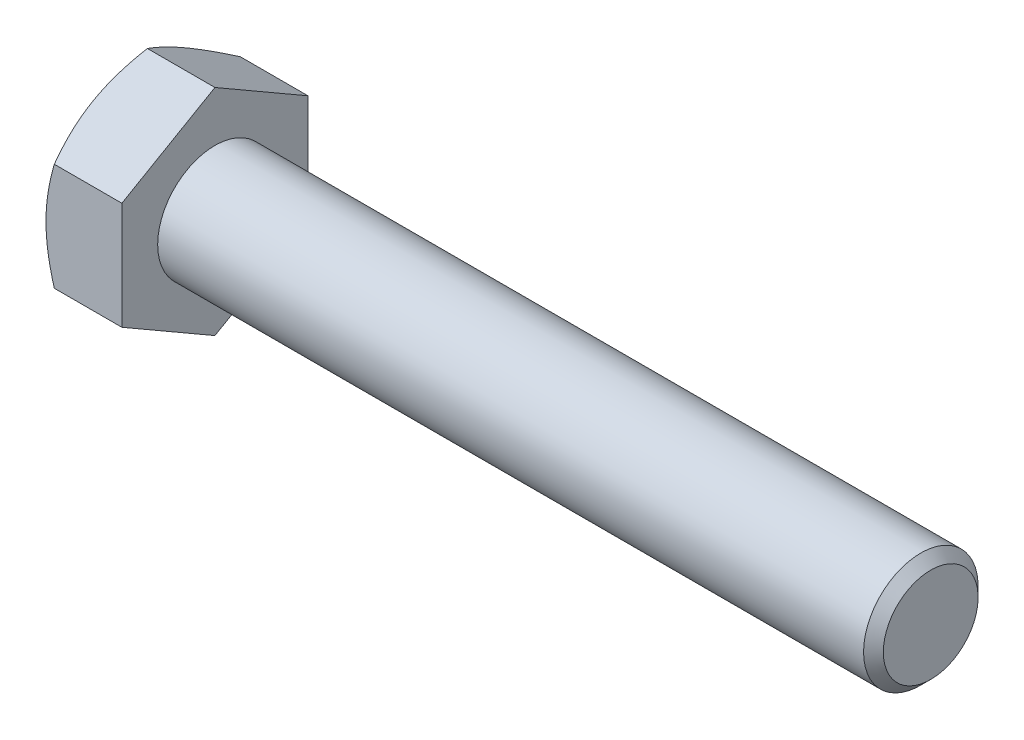
ISO-10303-21;
HEADER;
FILE_DESCRIPTION(('STEP AP214'),'2;1');
FILE_NAME('part.step','',(''),(''),'','','');
FILE_SCHEMA(('AUTOMOTIVE_DESIGN { 1 0 10303 214 1 1 1 1 }'));
ENDSEC;
DATA;
#1=APPLICATION_CONTEXT('core data for automotive mechanical design processes');
#2=APPLICATION_PROTOCOL_DEFINITION('international standard','automotive_design',2000,#1);
#3=PRODUCT_CONTEXT('',#1,'mechanical');
#4=PRODUCT('Part','Part','',(#3));
#5=PRODUCT_RELATED_PRODUCT_CATEGORY('part','',(#4));
#6=PRODUCT_DEFINITION_FORMATION('','',#4);
#7=PRODUCT_DEFINITION_CONTEXT('part definition',#1,'design');
#8=PRODUCT_DEFINITION('design','',#6,#7);
#9=PRODUCT_DEFINITION_SHAPE('','',#8);
#10=(LENGTH_UNIT() NAMED_UNIT(*) SI_UNIT(.MILLI.,.METRE.));
#11=(NAMED_UNIT(*) PLANE_ANGLE_UNIT() SI_UNIT($,.RADIAN.));
#12=(NAMED_UNIT(*) SI_UNIT($,.STERADIAN.) SOLID_ANGLE_UNIT());
#13=UNCERTAINTY_MEASURE_WITH_UNIT(LENGTH_MEASURE(1.E-05),#10,'distance_accuracy_value','');
#14=(GEOMETRIC_REPRESENTATION_CONTEXT(3) GLOBAL_UNCERTAINTY_ASSIGNED_CONTEXT((#13)) GLOBAL_UNIT_ASSIGNED_CONTEXT((#10,
#11,#12)) REPRESENTATION_CONTEXT('',''));
#15=CARTESIAN_POINT('',(0.,0.,0.));
#16=DIRECTION('',(0.,0.,1.));
#17=DIRECTION('',(1.,0.,0.));
#18=AXIS2_PLACEMENT_3D('',#15,#16,#17);
#19=CARTESIAN_POINT('',(0.,7.50555349946514,0.));
#20=DIRECTION('',(1.,0.,0.));
#21=DIRECTION('',(0.,0.,-1.));
#22=AXIS2_PLACEMENT_3D('',#19,#20,#21);
#23=PLANE('',#22);
#24=CARTESIAN_POINT('',(0.,0.,0.));
#25=DIRECTION('',(1.,0.,0.));
#26=DIRECTION('',(0.,0.,-1.));
#27=AXIS2_PLACEMENT_3D('',#24,#25,#26);
#28=CIRCLE('',#27,6.49999999995998);
#29=CARTESIAN_POINT('',(1.15555477460892E-11,-5.62916512458153,-3.24999999999));
#30=VERTEX_POINT('',#29);
#31=CARTESIAN_POINT('',(1.1552457738841E-11,0.,-6.49999999997999));
#32=VERTEX_POINT('',#31);
#33=EDGE_CURVE('E376',#30,#32,#28,.T.);
#34=ORIENTED_EDGE('',*,*,#33,.F.);
#35=CARTESIAN_POINT('',(0.,0.,0.));
#36=DIRECTION('',(1.,0.,0.));
#37=DIRECTION('',(0.,0.,-1.));
#38=AXIS2_PLACEMENT_3D('',#35,#36,#37);
#39=CIRCLE('',#38,6.49999999995998);
#40=CARTESIAN_POINT('',(1.15550411053332E-11,-5.62916512458152,3.24999999999001));
#41=VERTEX_POINT('',#40);
#42=EDGE_CURVE('E374',#41,#30,#39,.T.);
#43=ORIENTED_EDGE('',*,*,#42,.F.);
#44=CARTESIAN_POINT('',(0.,0.,0.));
#45=DIRECTION('',(1.,0.,0.));
#46=DIRECTION('',(0.,0.,-1.));
#47=AXIS2_PLACEMENT_3D('',#44,#45,#46);
#48=CIRCLE('',#47,6.49999999995998);
#49=CARTESIAN_POINT('',(1.15521679258111E-11,0.,6.49999999997999));
#50=VERTEX_POINT('',#49);
#51=EDGE_CURVE('E89',#50,#41,#48,.T.);
#52=ORIENTED_EDGE('',*,*,#51,.F.);
#53=CARTESIAN_POINT('',(0.,0.,0.));
#54=DIRECTION('',(1.,0.,0.));
#55=DIRECTION('',(0.,0.,-1.));
#56=AXIS2_PLACEMENT_3D('',#53,#54,#55);
#57=CIRCLE('',#56,6.49999999995998);
#58=CARTESIAN_POINT('',(1.15524765323843E-11,5.62916512458152,3.24999999999));
#59=VERTEX_POINT('',#58);
#60=EDGE_CURVE('E87',#59,#50,#57,.T.);
#61=ORIENTED_EDGE('',*,*,#60,.F.);
#62=CARTESIAN_POINT('',(0.,0.,0.));
#63=DIRECTION('',(1.,0.,0.));
#64=DIRECTION('',(0.,0.,-1.));
#65=AXIS2_PLACEMENT_3D('',#62,#63,#64);
#66=CIRCLE('',#65,6.49999999995998);
#67=CARTESIAN_POINT('',(1.15520344122427E-11,5.62916512458152,-3.24999999999));
#68=VERTEX_POINT('',#67);
#69=EDGE_CURVE('E19',#68,#59,#66,.T.);
#70=ORIENTED_EDGE('',*,*,#69,.F.);
#71=CARTESIAN_POINT('',(0.,0.,0.));
#72=DIRECTION('',(1.,0.,0.));
#73=DIRECTION('',(0.,0.,-1.));
#74=AXIS2_PLACEMENT_3D('',#71,#72,#73);
#75=CIRCLE('',#74,6.49999999995998);
#76=EDGE_CURVE('E290',#32,#68,#75,.T.);
#77=ORIENTED_EDGE('',*,*,#76,.F.);
#78=EDGE_LOOP('',(#34,#43,#52,#61,#70,#77));
#79=FACE_BOUND('',#78,.T.);
#80=ADVANCED_FACE('F16',(#79),#23,.F.);
#81=CARTESIAN_POINT('',(0.584039923126056,0.,0.));
#82=DIRECTION('',(1.,0.,0.));
#83=DIRECTION('',(0.,0.,-1.));
#84=AXIS2_PLACEMENT_3D('',#81,#82,#83);
#85=CONICAL_SURFACE('',#84,7.51158682049891,1.047197551212);
#86=CARTESIAN_POINT('',(0.580556583603038,7.50555349946481,-5.68456481556597E-13));
#87=CARTESIAN_POINT('',(0.492351589092373,7.35281628523265,-0.26454861525721));
#88=CARTESIAN_POINT('',(0.411540414604503,7.19885589650209,-0.531215830891591));
#89=CARTESIAN_POINT('',(0.269031363386546,6.88957797343578,-1.06690090730181));
#90=CARTESIAN_POINT('',(0.207238975555895,6.73427122699289,-1.33590008289911));
#91=CARTESIAN_POINT('',(0.131368414291871,6.49984538856281,-1.74193754566694));
#92=CARTESIAN_POINT('',(0.108872020464256,6.42140731241997,-1.8777962787943));
#93=CARTESIAN_POINT('',(0.0699302938009757,6.264155645091,-2.15016415618299));
#94=CARTESIAN_POINT('',(0.0534848017009781,6.18534206384378,-2.28667328322963));
#95=CARTESIAN_POINT('',(0.0269338255085263,6.02704786462284,-2.56084687882373));
#96=CARTESIAN_POINT('',(0.0168605830574699,5.94756588426557,-2.69851370708872));
#97=CARTESIAN_POINT('',(0.00337972763244669,5.78844560823805,-2.97411810968276));
#98=CARTESIAN_POINT('',(-2.65652346789022E-05,5.70880728473494,-3.11205573221976));
#99=CARTESIAN_POINT('',(2.31040688244853E-11,5.62916512459895,-3.24999999999983));
#100=B_SPLINE_CURVE_WITH_KNOTS('',3,(#86,#87,#88,#89,#90,#91,#92,#93,#94,#95,#96,#97,#98,#99),
.UNSPECIFIED.,.F.,.F.,(4,2,2,2,2,2,4),(0.,0.954247655906537,1.9036737621373,2.37900973801286,
2.85433320178906,3.332042816259,3.80984701130876),.UNSPECIFIED.);
#101=CARTESIAN_POINT('',(0.580556583603038,7.50555349946481,0.));
#102=VERTEX_POINT('',#101);
#103=EDGE_CURVE('E100',#102,#68,#100,.T.);
#104=ORIENTED_EDGE('',*,*,#103,.T.);
#105=ORIENTED_EDGE('',*,*,#69,.T.);
#106=CARTESIAN_POINT('',(2.38262969880455E-11,5.62916512459777,3.24999999999938));
#107=CARTESIAN_POINT('',(-2.65652344219582E-05,5.70880728473446,3.11205573221969));
#108=CARTESIAN_POINT('',(0.00337972763251203,5.78844560823787,2.97411810968284));
#109=CARTESIAN_POINT('',(0.016860583057394,5.94756588426561,2.69851370708889));
#110=CARTESIAN_POINT('',(0.0269338255085004,6.02704786462282,2.56084687882384));
#111=CARTESIAN_POINT('',(0.0534848017009882,6.18534206384371,2.28667328322969));
#112=CARTESIAN_POINT('',(0.0699302938009718,6.26415564509096,2.15016415618305));
#113=CARTESIAN_POINT('',(0.108872020464242,6.42140731241995,1.87779627879436));
#114=CARTESIAN_POINT('',(0.131368414291862,6.49984538856279,1.74193754566698));
#115=CARTESIAN_POINT('',(0.207238975555892,6.73427122699287,1.33590008289914));
#116=CARTESIAN_POINT('',(0.269031363386541,6.88957797343576,1.06690090730184));
#117=CARTESIAN_POINT('',(0.411540414604495,7.19885589650208,0.531215830891611));
#118=CARTESIAN_POINT('',(0.492351589092366,7.35281628523265,0.264548615257222));
#119=CARTESIAN_POINT('',(0.580556583603039,7.50555349946481,5.67774003086218E-13));
#120=B_SPLINE_CURVE_WITH_KNOTS('',3,(#106,#107,#108,#109,#110,#111,#112,#113,#114,#115,#116,
#117,#118,#119),.UNSPECIFIED.,.F.,.F.,(4,2,2,2,2,2,4),(0.,0.477804195049821,0.955513809519796,
1.43083727329602,1.90617324917161,2.85559935540238,3.80984701130895),.UNSPECIFIED.);
#121=EDGE_CURVE('E98',#59,#102,#120,.T.);
#122=ORIENTED_EDGE('',*,*,#121,.T.);
#123=EDGE_LOOP('',(#104,#105,#122));
#124=FACE_BOUND('',#123,.T.);
#125=ADVANCED_FACE('F96',(#124),#85,.T.);
#126=CARTESIAN_POINT('',(0.584039923126056,0.,0.));
#127=DIRECTION('',(1.,0.,0.));
#128=DIRECTION('',(0.,0.,-1.));
#129=AXIS2_PLACEMENT_3D('',#126,#127,#128);
#130=CONICAL_SURFACE('',#129,7.51158682049891,1.047197551212);
#131=CARTESIAN_POINT('',(0.580556583603035,3.75277674973289,6.49999999999943));
#132=CARTESIAN_POINT('',(0.49235158909237,3.90551396396506,6.23545138474279));
#133=CARTESIAN_POINT('',(0.411540414604501,4.05947435269561,5.96878416910841));
#134=CARTESIAN_POINT('',(0.269031363386546,4.36875227576192,5.4330990926982));
#135=CARTESIAN_POINT('',(0.207238975555895,4.5240590222048,5.1640999171009));
#136=CARTESIAN_POINT('',(0.131368414291871,4.75848486063488,4.75806245433307));
#137=CARTESIAN_POINT('',(0.108872020464256,4.83692293677773,4.62220372120571));
#138=CARTESIAN_POINT('',(0.0699302938009757,4.99417460410669,4.34983584381702));
#139=CARTESIAN_POINT('',(0.0534848017009788,5.07298818535391,4.21332671677038));
#140=CARTESIAN_POINT('',(0.0269338255085272,5.23128238457485,3.93915312117628));
#141=CARTESIAN_POINT('',(0.0168605830574704,5.31076436493213,3.80148629291129));
#142=CARTESIAN_POINT('',(0.00337972763244649,5.46988464095964,3.52588189031725));
#143=CARTESIAN_POINT('',(-2.6565234679261E-05,5.54952296446275,3.38794426778026));
#144=CARTESIAN_POINT('',(2.31044109636824E-11,5.62916512459874,3.25000000000019));
#145=B_SPLINE_CURVE_WITH_KNOTS('',3,(#131,#132,#133,#134,#135,#136,#137,#138,#139,#140,#141,
#142,#143,#144),.UNSPECIFIED.,.F.,.F.,(4,2,2,2,2,2,4),(0.,0.954247655906532,1.90367376213729,
2.37900973801285,2.85433320178905,3.33204281625899,3.80984701130875),.UNSPECIFIED.);
#146=CARTESIAN_POINT('',(0.580556583603035,3.7527767497324,6.49999999999972));
#147=VERTEX_POINT('',#146);
#148=EDGE_CURVE('E104',#147,#59,#145,.T.);
#149=ORIENTED_EDGE('',*,*,#148,.T.);
#150=ORIENTED_EDGE('',*,*,#60,.T.);
#151=CARTESIAN_POINT('',(2.38266512998069E-11,0.,6.49999999999875));
#152=CARTESIAN_POINT('',(-2.65652344227332E-05,0.159284320272008,6.49999999999955));
#153=CARTESIAN_POINT('',(0.0033797276325113,0.31856096727825,6.49999999999988));
#154=CARTESIAN_POINT('',(0.0168605830573939,0.636801519333313,6.50000000000012));
#155=CARTESIAN_POINT('',(0.0269338255085009,0.795765480047878,6.50000000000003));
#156=CARTESIAN_POINT('',(0.0534848017009887,1.11235387848978,6.49999999999997));
#157=CARTESIAN_POINT('',(0.0699302938009717,1.26998104098423,6.49999999999999));
#158=CARTESIAN_POINT('',(0.108872020464242,1.58448437564217,6.50000000000001));
#159=CARTESIAN_POINT('',(0.131368414291861,1.74136052792787,6.5));
#160=CARTESIAN_POINT('',(0.207238975555891,2.21021220478804,6.49999999999999));
#161=CARTESIAN_POINT('',(0.26903136338654,2.52082569767382,6.5));
#162=CARTESIAN_POINT('',(0.411540414604493,3.13938154380644,6.5));
#163=CARTESIAN_POINT('',(0.492351589092363,3.44730232126757,6.50000000000001));
#164=CARTESIAN_POINT('',(0.580556583603035,3.75277674973191,6.5));
#165=B_SPLINE_CURVE_WITH_KNOTS('',3,(#151,#152,#153,#154,#155,#156,#157,#158,#159,#160,#161,
#162,#163,#164),.UNSPECIFIED.,.F.,.F.,(4,2,2,2,2,2,4),(0.,0.477804195049819,0.955513809519793,
1.43083727329602,1.90617324917161,2.85559935540237,3.80984701130894),.UNSPECIFIED.);
#166=EDGE_CURVE('E107',#50,#147,#165,.T.);
#167=ORIENTED_EDGE('',*,*,#166,.T.);
#168=EDGE_LOOP('',(#149,#150,#167));
#169=FACE_BOUND('',#168,.T.);
#170=ADVANCED_FACE('F105',(#169),#130,.T.);
#171=CARTESIAN_POINT('',(0.584039923126056,0.,0.));
#172=DIRECTION('',(1.,0.,0.));
#173=DIRECTION('',(0.,0.,-1.));
#174=AXIS2_PLACEMENT_3D('',#171,#172,#173);
#175=CONICAL_SURFACE('',#174,7.51158682049891,1.047197551212);
#176=ORIENTED_EDGE('',*,*,#51,.T.);
#177=CARTESIAN_POINT('',(2.38331262092634E-11,-5.62916512459777,3.24999999999939));
#178=CARTESIAN_POINT('',(-2.65652344164461E-05,-5.54952296446246,3.38794426777988));
#179=CARTESIAN_POINT('',(0.0033797276325173,-5.46988464095963,3.52588189031706));
#180=CARTESIAN_POINT('',(0.0168605830573994,-5.3107643649323,3.80148629291125));
#181=CARTESIAN_POINT('',(0.0269338255085061,-5.23128238457494,3.93915312117621));
#182=CARTESIAN_POINT('',(0.0534848017009937,-5.07298818535394,4.21332671677029));
#183=CARTESIAN_POINT('',(0.0699302938009766,-4.99417460410673,4.34983584381695));
#184=CARTESIAN_POINT('',(0.108872020464246,-4.83692293677778,4.62220372120566));
#185=CARTESIAN_POINT('',(0.131368414291866,-4.75848486063492,4.75806245433303));
#186=CARTESIAN_POINT('',(0.207238975555896,-4.52405902220483,5.16409991710086));
#187=CARTESIAN_POINT('',(0.269031363386544,-4.36875227576194,5.43309909269816));
#188=CARTESIAN_POINT('',(0.411540414604496,-4.05947435269564,5.96878416910839));
#189=CARTESIAN_POINT('',(0.492351589092366,-3.90551396396508,6.23545138474278));
#190=CARTESIAN_POINT('',(0.580556583603037,-3.7527767497329,6.49999999999943));
#191=B_SPLINE_CURVE_WITH_KNOTS('',3,(#177,#178,#179,#180,#181,#182,#183,#184,#185,#186,#187,
#188,#189,#190),.UNSPECIFIED.,.F.,.F.,(4,2,2,2,2,2,4),(0.,0.477804195049818,0.955513809519791,
1.43083727329601,1.9061732491716,2.85559935540236,3.80984701130893),.UNSPECIFIED.);
#192=CARTESIAN_POINT('',(0.580556583603037,-3.75277674973241,6.49999999999971));
#193=VERTEX_POINT('',#192);
#194=EDGE_CURVE('E189',#41,#193,#191,.T.);
#195=ORIENTED_EDGE('',*,*,#194,.T.);
#196=CARTESIAN_POINT('',(0.580556583603038,-3.75277674973192,6.5));
#197=CARTESIAN_POINT('',(0.492351589092373,-3.44730232126759,6.5));
#198=CARTESIAN_POINT('',(0.411540414604503,-3.13938154380647,6.5));
#199=CARTESIAN_POINT('',(0.269031363386547,-2.52082569767387,6.5));
#200=CARTESIAN_POINT('',(0.207238975555896,-2.21021220478809,6.5));
#201=CARTESIAN_POINT('',(0.131368414291872,-1.74136052792793,6.5));
#202=CARTESIAN_POINT('',(0.108872020464256,-1.58448437564224,6.5));
#203=CARTESIAN_POINT('',(0.069930293800976,-1.26998104098431,6.5));
#204=CARTESIAN_POINT('',(0.0534848017009787,-1.11235387848987,6.5));
#205=CARTESIAN_POINT('',(0.026933825508527,-0.795765480047989,6.5));
#206=CARTESIAN_POINT('',(0.0168605830574705,-0.636801519333436,6.5));
#207=CARTESIAN_POINT('',(0.00337972763244701,-0.318560967278408,6.5));
#208=CARTESIAN_POINT('',(-2.65652346786707E-05,-0.159284320272188,6.5));
#209=CARTESIAN_POINT('',(2.31044610445054E-11,-2.08059797367535E-13,6.5));
#210=B_SPLINE_CURVE_WITH_KNOTS('',3,(#196,#197,#198,#199,#200,#201,#202,#203,#204,#205,#206,
#207,#208,#209),.UNSPECIFIED.,.F.,.F.,(4,2,2,2,2,2,4),(0.,0.954247655906535,1.9036737621373,
2.37900973801286,2.85433320178906,3.33204281625899,3.80984701130876),.UNSPECIFIED.);
#211=EDGE_CURVE('E161',#193,#50,#210,.T.);
#212=ORIENTED_EDGE('',*,*,#211,.T.);
#213=EDGE_LOOP('',(#176,#195,#212));
#214=FACE_BOUND('',#213,.T.);
#215=ADVANCED_FACE('F150',(#214),#175,.T.);
#216=CARTESIAN_POINT('',(0.584039923126056,0.,0.));
#217=DIRECTION('',(1.,0.,0.));
#218=DIRECTION('',(0.,0.,-1.));
#219=AXIS2_PLACEMENT_3D('',#216,#217,#218);
#220=CONICAL_SURFACE('',#219,7.51158682049891,1.047197551212);
#221=ORIENTED_EDGE('',*,*,#42,.T.);
#222=CARTESIAN_POINT('',(2.38342887376555E-11,-5.62916512459777,-3.24999999999938));
#223=CARTESIAN_POINT('',(-2.65652344147577E-05,-5.70880728473447,-3.11205573221969));
#224=CARTESIAN_POINT('',(0.00337972763251886,-5.78844560823788,-2.97411810968284));
#225=CARTESIAN_POINT('',(0.0168605830574005,-5.94756588426562,-2.69851370708889));
#226=CARTESIAN_POINT('',(0.0269338255085069,-6.02704786462283,-2.56084687882384));
#227=CARTESIAN_POINT('',(0.0534848017009949,-6.18534206384372,-2.2866732832297));
#228=CARTESIAN_POINT('',(0.0699302938009785,-6.26415564509097,-2.15016415618305));
#229=CARTESIAN_POINT('',(0.108872020464249,-6.42140731241996,-1.87779627879436));
#230=CARTESIAN_POINT('',(0.131368414291869,-6.4998453885628,-1.74193754566699));
#231=CARTESIAN_POINT('',(0.207238975555899,-6.73427122699288,-1.33590008289914));
#232=CARTESIAN_POINT('',(0.269031363386548,-6.88957797343577,-1.06690090730184));
#233=CARTESIAN_POINT('',(0.411540414604502,-7.19885589650209,-0.531215830891612));
#234=CARTESIAN_POINT('',(0.492351589092373,-7.35281628523266,-0.264548615257222));
#235=CARTESIAN_POINT('',(0.580556583603045,-7.50555349946482,-5.67704371195565E-13));
#236=B_SPLINE_CURVE_WITH_KNOTS('',3,(#222,#223,#224,#225,#226,#227,#228,#229,#230,#231,#232,
#233,#234,#235),.UNSPECIFIED.,.F.,.F.,(4,2,2,2,2,2,4),(0.,0.47780419504982,0.955513809519797,
1.43083727329602,1.90617324917161,2.85559935540238,3.80984701130896),.UNSPECIFIED.);
#237=CARTESIAN_POINT('',(0.580556583603045,-7.50555349946482,0.));
#238=VERTEX_POINT('',#237);
#239=EDGE_CURVE('E342',#30,#238,#236,.T.);
#240=ORIENTED_EDGE('',*,*,#239,.T.);
#241=CARTESIAN_POINT('',(0.580556583603045,-7.50555349946482,5.69366376944182E-13));
#242=CARTESIAN_POINT('',(0.492351589092379,-7.35281628523266,0.264548615257211));
#243=CARTESIAN_POINT('',(0.411540414604509,-7.1988558965021,0.531215830891592));
#244=CARTESIAN_POINT('',(0.269031363386554,-6.8895779734358,1.06690090730181));
#245=CARTESIAN_POINT('',(0.207238975555903,-6.73427122699291,1.33590008289911));
#246=CARTESIAN_POINT('',(0.131368414291878,-6.49984538856283,1.74193754566694));
#247=CARTESIAN_POINT('',(0.108872020464262,-6.42140731241998,1.8777962787943));
#248=CARTESIAN_POINT('',(0.0699302938009814,-6.26415564509101,2.15016415618299));
#249=CARTESIAN_POINT('',(0.0534848017009844,-6.18534206384379,2.28667328322964));
#250=CARTESIAN_POINT('',(0.0269338255085328,-6.02704786462285,2.56084687882373));
#251=CARTESIAN_POINT('',(0.0168605830574762,-5.94756588426558,2.69851370708873));
#252=CARTESIAN_POINT('',(0.00337972763245243,-5.78844560823806,2.97411810968276));
#253=CARTESIAN_POINT('',(-2.65652346733646E-05,-5.70880728473495,3.11205573221976));
#254=CARTESIAN_POINT('',(2.31099570177832E-11,-5.62916512459896,3.24999999999983));
#255=B_SPLINE_CURVE_WITH_KNOTS('',3,(#241,#242,#243,#244,#245,#246,#247,#248,#249,#250,#251,
#252,#253,#254),.UNSPECIFIED.,.F.,.F.,(4,2,2,2,2,2,4),(0.,0.954247655906537,1.9036737621373,
2.37900973801286,2.85433320178906,3.332042816259,3.80984701130877),.UNSPECIFIED.);
#256=EDGE_CURVE('E183',#238,#41,#255,.T.);
#257=ORIENTED_EDGE('',*,*,#256,.T.);
#258=EDGE_LOOP('',(#221,#240,#257));
#259=FACE_BOUND('',#258,.T.);
#260=ADVANCED_FACE('F365',(#259),#220,.T.);
#261=CARTESIAN_POINT('',(0.584039923126056,0.,0.));
#262=DIRECTION('',(1.,0.,0.));
#263=DIRECTION('',(0.,0.,-1.));
#264=AXIS2_PLACEMENT_3D('',#261,#262,#263);
#265=CONICAL_SURFACE('',#264,7.51158682049891,1.047197551212);
#266=ORIENTED_EDGE('',*,*,#33,.T.);
#267=CARTESIAN_POINT('',(2.38274285891329E-11,0.,-6.49999999999875));
#268=CARTESIAN_POINT('',(-2.6565234421441E-05,-0.159284320272008,-6.49999999999955));
#269=CARTESIAN_POINT('',(0.00337972763251244,-0.318560967278251,-6.49999999999988));
#270=CARTESIAN_POINT('',(0.0168605830573945,-0.636801519333316,-6.50000000000012));
#271=CARTESIAN_POINT('',(0.0269338255085012,-0.795765480047881,-6.50000000000003));
#272=CARTESIAN_POINT('',(0.0534848017009894,-1.11235387848978,-6.49999999999997));
#273=CARTESIAN_POINT('',(0.069930293800973,-1.26998104098423,-6.49999999999999));
#274=CARTESIAN_POINT('',(0.108872020464243,-1.58448437564218,-6.50000000000001));
#275=CARTESIAN_POINT('',(0.131368414291863,-1.74136052792788,-6.50000000000001));
#276=CARTESIAN_POINT('',(0.207238975555893,-2.21021220478805,-6.5));
#277=CARTESIAN_POINT('',(0.269031363386542,-2.52082569767383,-6.5));
#278=CARTESIAN_POINT('',(0.411540414604496,-3.13938154380645,-6.50000000000001));
#279=CARTESIAN_POINT('',(0.492351589092367,-3.44730232126758,-6.50000000000001));
#280=CARTESIAN_POINT('',(0.580556583603039,-3.75277674973192,-6.5));
#281=B_SPLINE_CURVE_WITH_KNOTS('',3,(#267,#268,#269,#270,#271,#272,#273,#274,#275,#276,#277,
#278,#279,#280),.UNSPECIFIED.,.F.,.F.,(4,2,2,2,2,2,4),(0.,0.477804195049821,0.955513809519797,
1.43083727329602,1.90617324917161,2.85559935540238,3.80984701130895),.UNSPECIFIED.);
#282=CARTESIAN_POINT('',(0.580556583603039,-3.75277674973241,-6.49999999999972));
#283=VERTEX_POINT('',#282);
#284=EDGE_CURVE('E265',#32,#283,#281,.T.);
#285=ORIENTED_EDGE('',*,*,#284,.T.);
#286=CARTESIAN_POINT('',(0.580556583603039,-3.75277674973291,-6.49999999999943));
#287=CARTESIAN_POINT('',(0.492351589092374,-3.90551396396507,-6.23545138474279));
#288=CARTESIAN_POINT('',(0.411540414604505,-4.05947435269563,-5.96878416910841));
#289=CARTESIAN_POINT('',(0.269031363386551,-4.36875227576193,-5.4330990926982));
#290=CARTESIAN_POINT('',(0.2072389755559,-4.52405902220482,-5.1640999171009));
#291=CARTESIAN_POINT('',(0.131368414291877,-4.7584848606349,-4.75806245433307));
#292=CARTESIAN_POINT('',(0.108872020464262,-4.83692293677774,-4.62220372120571));
#293=CARTESIAN_POINT('',(0.0699302938009821,-4.9941746041067,-4.34983584381703));
#294=CARTESIAN_POINT('',(0.0534848017009851,-5.07298818535393,-4.21332671677038));
#295=CARTESIAN_POINT('',(0.0269338255085335,-5.23128238457487,-3.93915312117628));
#296=CARTESIAN_POINT('',(0.0168605830574768,-5.31076436493214,-3.80148629291129));
#297=CARTESIAN_POINT('',(0.00337972763245304,-5.46988464095966,-3.52588189031725));
#298=CARTESIAN_POINT('',(-2.65652346726809E-05,-5.54952296446277,-3.38794426778026));
#299=CARTESIAN_POINT('',(2.3110845106412E-11,-5.62916512459875,-3.25000000000019));
#300=B_SPLINE_CURVE_WITH_KNOTS('',3,(#286,#287,#288,#289,#290,#291,#292,#293,#294,#295,#296,
#297,#298,#299),.UNSPECIFIED.,.F.,.F.,(4,2,2,2,2,2,4),(0.,0.954247655906531,1.90367376213729,
2.37900973801285,2.85433320178905,3.33204281625898,3.80984701130874),.UNSPECIFIED.);
#301=EDGE_CURVE('E341',#283,#30,#300,.T.);
#302=ORIENTED_EDGE('',*,*,#301,.T.);
#303=EDGE_LOOP('',(#266,#285,#302));
#304=FACE_BOUND('',#303,.T.);
#305=ADVANCED_FACE('F280',(#304),#265,.T.);
#306=CARTESIAN_POINT('',(0.584039923126056,0.,0.));
#307=DIRECTION('',(1.,0.,0.));
#308=DIRECTION('',(0.,0.,-1.));
#309=AXIS2_PLACEMENT_3D('',#306,#307,#308);
#310=CONICAL_SURFACE('',#309,7.51158682049891,1.047197551212);
#311=CARTESIAN_POINT('',(0.580556583603034,3.7527767497319,-6.5));
#312=CARTESIAN_POINT('',(0.49235158909237,3.44730232126758,-6.5));
#313=CARTESIAN_POINT('',(0.4115404146045,3.13938154380646,-6.5));
#314=CARTESIAN_POINT('',(0.269031363386546,2.52082569767386,-6.5));
#315=CARTESIAN_POINT('',(0.207238975555895,2.21021220478808,-6.5));
#316=CARTESIAN_POINT('',(0.131368414291872,1.74136052792792,-6.5));
#317=CARTESIAN_POINT('',(0.108872020464256,1.58448437564224,-6.5));
#318=CARTESIAN_POINT('',(0.069930293800976,1.26998104098431,-6.5));
#319=CARTESIAN_POINT('',(0.0534848017009787,1.11235387848986,-6.5));
#320=CARTESIAN_POINT('',(0.0269338255085272,0.795765480047986,-6.5));
#321=CARTESIAN_POINT('',(0.016860583057471,0.636801519333434,-6.5));
#322=CARTESIAN_POINT('',(0.00337972763244778,0.318560967278407,-6.5));
#323=CARTESIAN_POINT('',(-2.65652346778902E-05,0.159284320272187,-6.5));
#324=CARTESIAN_POINT('',(2.3104915477682E-11,2.07807434490731E-13,-6.5));
#325=B_SPLINE_CURVE_WITH_KNOTS('',3,(#311,#312,#313,#314,#315,#316,#317,#318,#319,#320,#321,
#322,#323,#324),.UNSPECIFIED.,.F.,.F.,(4,2,2,2,2,2,4),(0.,0.954247655906532,1.90367376213729,
2.37900973801285,2.85433320178905,3.33204281625898,3.80984701130874),.UNSPECIFIED.);
#326=CARTESIAN_POINT('',(0.580556583603129,3.75277674973273,-6.49999999999972));
#327=VERTEX_POINT('',#326);
#328=EDGE_CURVE('E255',#327,#32,#325,.T.);
#329=ORIENTED_EDGE('',*,*,#328,.T.);
#330=ORIENTED_EDGE('',*,*,#76,.T.);
#331=CARTESIAN_POINT('',(2.38257762237078E-11,5.62916512459776,-3.24999999999938));
#332=CARTESIAN_POINT('',(-2.65652344229916E-05,5.54952296446245,-3.38794426777988));
#333=CARTESIAN_POINT('',(0.00337972763251109,5.46988464095962,-3.52588189031706));
#334=CARTESIAN_POINT('',(0.0168605830573934,5.31076436493229,-3.80148629291124));
#335=CARTESIAN_POINT('',(0.0269338255085001,5.23128238457493,-3.9391531211762));
#336=CARTESIAN_POINT('',(0.0534848017009878,5.07298818535393,-4.21332671677028));
#337=CARTESIAN_POINT('',(0.069930293800971,4.99417460410672,-4.34983584381695));
#338=CARTESIAN_POINT('',(0.108872020464241,4.83692293677777,-4.62220372120566));
#339=CARTESIAN_POINT('',(0.131368414291861,4.75848486063491,-4.75806245433303));
#340=CARTESIAN_POINT('',(0.207238975555891,4.52405902220482,-5.16409991710086));
#341=CARTESIAN_POINT('',(0.269031363386539,4.36875227576193,-5.43309909269817));
#342=CARTESIAN_POINT('',(0.411540414604492,4.05947435269563,-5.9687841691084));
#343=CARTESIAN_POINT('',(0.492351589092362,3.90551396396506,-6.23545138474279));
#344=CARTESIAN_POINT('',(0.580556583603035,3.75277674973289,-6.49999999999943));
#345=B_SPLINE_CURVE_WITH_KNOTS('',3,(#331,#332,#333,#334,#335,#336,#337,#338,#339,#340,#341,
#342,#343,#344),.UNSPECIFIED.,.F.,.F.,(4,2,2,2,2,2,4),(0.,0.477804195049819,0.955513809519792,
1.43083727329602,1.90617324917161,2.85559935540237,3.80984701130894),.UNSPECIFIED.);
#346=EDGE_CURVE('E123',#68,#327,#345,.T.);
#347=ORIENTED_EDGE('',*,*,#346,.T.);
#348=EDGE_LOOP('',(#329,#330,#347));
#349=FACE_BOUND('',#348,.T.);
#350=ADVANCED_FACE('F275',(#349),#310,.T.);
#351=CARTESIAN_POINT('',(55.3,0.,0.));
#352=DIRECTION('',(-1.,0.,0.));
#353=DIRECTION('',(0.,0.,1.));
#354=AXIS2_PLACEMENT_3D('',#351,#352,#353);
#355=PLANE('',#354);
#356=CARTESIAN_POINT('',(55.2999999999315,0.,0.));
#357=DIRECTION('',(-1.,0.,0.));
#358=DIRECTION('',(0.,0.,1.));
#359=AXIS2_PLACEMENT_3D('',#356,#357,#358);
#360=CIRCLE('',#359,3.3095000000003);
#361=CARTESIAN_POINT('',(55.2999999999315,0.,3.3095000000003));
#362=VERTEX_POINT('',#361);
#363=EDGE_CURVE('E220',#362,#362,#360,.T.);
#364=ORIENTED_EDGE('',*,*,#363,.F.);
#365=EDGE_LOOP('',(#364));
#366=FACE_BOUND('',#365,.T.);
#367=ADVANCED_FACE('F279',(#366),#355,.F.);
#368=CARTESIAN_POINT('',(5.3,3.75277674973256,-6.5));
#369=DIRECTION('',(0.,-0.866025403784438,0.500000000000001));
#370=DIRECTION('',(0.,-0.500000000000001,-0.866025403784438));
#371=AXIS2_PLACEMENT_3D('',#368,#369,#370);
#372=PLANE('',#371);
#373=DIRECTION('',(1.,0.,0.));
#374=VECTOR('',#373,1.);
#375=CARTESIAN_POINT('',(5.3,7.50555349946514,0.));
#376=LINE('',#375,#374);
#377=CARTESIAN_POINT('',(5.3,7.50555349946514,0.));
#378=VERTEX_POINT('',#377);
#379=EDGE_CURVE('E111',#102,#378,#376,.T.);
#380=ORIENTED_EDGE('',*,*,#379,.T.);
#381=DIRECTION('',(0.,0.500000000000001,0.866025403784438));
#382=VECTOR('',#381,1.);
#383=CARTESIAN_POINT('',(5.3,3.75277674973256,-6.5));
#384=LINE('',#383,#382);
#385=CARTESIAN_POINT('',(5.3,3.75277674973256,-6.5));
#386=VERTEX_POINT('',#385);
#387=EDGE_CURVE('E215',#386,#378,#384,.T.);
#388=ORIENTED_EDGE('',*,*,#387,.F.);
#389=DIRECTION('',(1.,0.,0.));
#390=VECTOR('',#389,1.);
#391=CARTESIAN_POINT('',(5.3,3.75277674973256,-6.5));
#392=LINE('',#391,#390);
#393=EDGE_CURVE('E264',#386,#327,#392,.F.);
#394=ORIENTED_EDGE('',*,*,#393,.T.);
#395=ORIENTED_EDGE('',*,*,#346,.F.);
#396=ORIENTED_EDGE('',*,*,#103,.F.);
#397=EDGE_LOOP('',(#380,#388,#394,#395,#396));
#398=FACE_BOUND('',#397,.T.);
#399=ADVANCED_FACE('F292',(#398),#372,.F.);
#400=CARTESIAN_POINT('',(5.3,7.50555349946514,0.));
#401=DIRECTION('',(0.,-0.866025403784438,-0.500000000000001));
#402=DIRECTION('',(0.,0.500000000000001,-0.866025403784438));
#403=AXIS2_PLACEMENT_3D('',#400,#401,#402);
#404=PLANE('',#403);
#405=DIRECTION('',(1.,0.,0.));
#406=VECTOR('',#405,1.);
#407=CARTESIAN_POINT('',(5.3,3.75277674973256,6.5));
#408=LINE('',#407,#406);
#409=CARTESIAN_POINT('',(5.3,3.75277674973256,6.5));
#410=VERTEX_POINT('',#409);
#411=EDGE_CURVE('E160',#147,#410,#408,.T.);
#412=ORIENTED_EDGE('',*,*,#411,.T.);
#413=DIRECTION('',(0.,-0.500000000000001,0.866025403784438));
#414=VECTOR('',#413,1.);
#415=CARTESIAN_POINT('',(5.3,7.50555349946514,0.));
#416=LINE('',#415,#414);
#417=EDGE_CURVE('E219',#378,#410,#416,.T.);
#418=ORIENTED_EDGE('',*,*,#417,.F.);
#419=ORIENTED_EDGE('',*,*,#379,.F.);
#420=ORIENTED_EDGE('',*,*,#121,.F.);
#421=ORIENTED_EDGE('',*,*,#148,.F.);
#422=EDGE_LOOP('',(#412,#418,#419,#420,#421));
#423=FACE_BOUND('',#422,.T.);
#424=ADVANCED_FACE('F114',(#423),#404,.F.);
#425=CARTESIAN_POINT('',(5.3,3.75277674973256,6.5));
#426=DIRECTION('',(0.,0.,-1.));
#427=DIRECTION('',(0.,1.,0.));
#428=AXIS2_PLACEMENT_3D('',#425,#426,#427);
#429=PLANE('',#428);
#430=DIRECTION('',(1.,0.,0.));
#431=VECTOR('',#430,1.);
#432=CARTESIAN_POINT('',(5.3,-3.75277674973258,6.5));
#433=LINE('',#432,#431);
#434=CARTESIAN_POINT('',(5.3,-3.75277674973257,6.5));
#435=VERTEX_POINT('',#434);
#436=EDGE_CURVE('E195',#193,#435,#433,.T.);
#437=ORIENTED_EDGE('',*,*,#436,.T.);
#438=DIRECTION('',(0.,1.,0.));
#439=VECTOR('',#438,1.);
#440=CARTESIAN_POINT('',(5.3,7.50555349946514,6.5));
#441=LINE('',#440,#439);
#442=EDGE_CURVE('E239',#410,#435,#441,.F.);
#443=ORIENTED_EDGE('',*,*,#442,.F.);
#444=ORIENTED_EDGE('',*,*,#411,.F.);
#445=ORIENTED_EDGE('',*,*,#166,.F.);
#446=ORIENTED_EDGE('',*,*,#211,.F.);
#447=EDGE_LOOP('',(#437,#443,#444,#445,#446));
#448=FACE_BOUND('',#447,.T.);
#449=ADVANCED_FACE('F167',(#448),#429,.F.);
#450=CARTESIAN_POINT('',(5.3,-7.50555349946515,0.));
#451=DIRECTION('',(0.,0.866025403784438,-0.500000000000001));
#452=DIRECTION('',(0.,0.500000000000001,0.866025403784438));
#453=AXIS2_PLACEMENT_3D('',#450,#451,#452);
#454=PLANE('',#453);
#455=DIRECTION('',(1.,0.,0.));
#456=VECTOR('',#455,1.);
#457=CARTESIAN_POINT('',(5.3,-7.50555349946515,0.));
#458=LINE('',#457,#456);
#459=CARTESIAN_POINT('',(5.3,-7.50555349946515,0.));
#460=VERTEX_POINT('',#459);
#461=EDGE_CURVE('E338',#238,#460,#458,.T.);
#462=ORIENTED_EDGE('',*,*,#461,.T.);
#463=DIRECTION('',(0.,-0.500000000000001,-0.866025403784438));
#464=VECTOR('',#463,1.);
#465=CARTESIAN_POINT('',(5.3,-3.75277674973257,6.5));
#466=LINE('',#465,#464);
#467=EDGE_CURVE('E233',#435,#460,#466,.T.);
#468=ORIENTED_EDGE('',*,*,#467,.F.);
#469=ORIENTED_EDGE('',*,*,#436,.F.);
#470=ORIENTED_EDGE('',*,*,#194,.F.);
#471=ORIENTED_EDGE('',*,*,#256,.F.);
#472=EDGE_LOOP('',(#462,#468,#469,#470,#471));
#473=FACE_BOUND('',#472,.T.);
#474=ADVANCED_FACE('F171',(#473),#454,.F.);
#475=CARTESIAN_POINT('',(5.3,-3.75277674973258,-6.5));
#476=DIRECTION('',(0.,0.866025403784438,0.500000000000001));
#477=DIRECTION('',(0.,-0.500000000000001,0.866025403784438));
#478=AXIS2_PLACEMENT_3D('',#475,#476,#477);
#479=PLANE('',#478);
#480=DIRECTION('',(1.,0.,0.));
#481=VECTOR('',#480,1.);
#482=CARTESIAN_POINT('',(5.3,-3.75277674973258,-6.5));
#483=LINE('',#482,#481);
#484=CARTESIAN_POINT('',(5.3,-3.75277674973258,-6.5));
#485=VERTEX_POINT('',#484);
#486=EDGE_CURVE('E35',#283,#485,#483,.T.);
#487=ORIENTED_EDGE('',*,*,#486,.T.);
#488=DIRECTION('',(0.,0.500000000000001,-0.866025403784438));
#489=VECTOR('',#488,1.);
#490=CARTESIAN_POINT('',(5.3,-7.50555349946515,0.));
#491=LINE('',#490,#489);
#492=EDGE_CURVE('E227',#460,#485,#491,.T.);
#493=ORIENTED_EDGE('',*,*,#492,.F.);
#494=ORIENTED_EDGE('',*,*,#461,.F.);
#495=ORIENTED_EDGE('',*,*,#239,.F.);
#496=ORIENTED_EDGE('',*,*,#301,.F.);
#497=EDGE_LOOP('',(#487,#493,#494,#495,#496));
#498=FACE_BOUND('',#497,.T.);
#499=ADVANCED_FACE('F177',(#498),#479,.F.);
#500=CARTESIAN_POINT('',(5.3,3.75277674973256,-6.5));
#501=DIRECTION('',(0.,0.,1.));
#502=DIRECTION('',(0.,-1.,0.));
#503=AXIS2_PLACEMENT_3D('',#500,#501,#502);
#504=PLANE('',#503);
#505=ORIENTED_EDGE('',*,*,#393,.F.);
#506=DIRECTION('',(0.,1.,0.));
#507=VECTOR('',#506,1.);
#508=CARTESIAN_POINT('',(5.3,7.50555349946514,-6.5));
#509=LINE('',#508,#507);
#510=EDGE_CURVE('E223',#485,#386,#509,.T.);
#511=ORIENTED_EDGE('',*,*,#510,.F.);
#512=ORIENTED_EDGE('',*,*,#486,.F.);
#513=ORIENTED_EDGE('',*,*,#284,.F.);
#514=ORIENTED_EDGE('',*,*,#328,.F.);
#515=EDGE_LOOP('',(#505,#511,#512,#513,#514));
#516=FACE_BOUND('',#515,.T.);
#517=ADVANCED_FACE('F272',(#516),#504,.F.);
#518=CARTESIAN_POINT('',(54.6094999999696,0.,0.));
#519=DIRECTION('',(-1.,0.,0.));
#520=DIRECTION('',(0.,0.,1.));
#521=AXIS2_PLACEMENT_3D('',#518,#519,#520);
#522=CONICAL_SURFACE('',#521,4.0000000000191,0.785398163438609);
#523=CARTESIAN_POINT('',(54.6095,0.,0.));
#524=DIRECTION('',(-1.,0.,0.));
#525=DIRECTION('',(0.,0.,1.));
#526=AXIS2_PLACEMENT_3D('',#523,#524,#525);
#527=CIRCLE('',#526,4.);
#528=CARTESIAN_POINT('',(54.6095,0.,4.));
#529=VERTEX_POINT('',#528);
#530=EDGE_CURVE('E26',#529,#529,#527,.T.);
#531=ORIENTED_EDGE('',*,*,#530,.F.);
#532=EDGE_LOOP('',(#531));
#533=FACE_BOUND('',#532,.T.);
#534=ORIENTED_EDGE('',*,*,#363,.T.);
#535=EDGE_LOOP('',(#534));
#536=FACE_BOUND('',#535,.T.);
#537=ADVANCED_FACE('F311',(#533,#536),#522,.T.);
#538=CARTESIAN_POINT('',(5.3,7.50555349946514,0.));
#539=DIRECTION('',(1.,0.,0.));
#540=DIRECTION('',(0.,0.,-1.));
#541=AXIS2_PLACEMENT_3D('',#538,#539,#540);
#542=PLANE('',#541);
#543=CARTESIAN_POINT('',(5.3,0.,0.));
#544=DIRECTION('',(-1.,0.,0.));
#545=DIRECTION('',(0.,0.,1.));
#546=AXIS2_PLACEMENT_3D('',#543,#544,#545);
#547=CIRCLE('',#546,4.);
#548=CARTESIAN_POINT('',(5.3,0.,4.));
#549=VERTEX_POINT('',#548);
#550=EDGE_CURVE('E11',#549,#549,#547,.F.);
#551=ORIENTED_EDGE('',*,*,#550,.F.);
#552=EDGE_LOOP('',(#551));
#553=FACE_BOUND('',#552,.T.);
#554=ORIENTED_EDGE('',*,*,#492,.T.);
#555=ORIENTED_EDGE('',*,*,#510,.T.);
#556=ORIENTED_EDGE('',*,*,#387,.T.);
#557=ORIENTED_EDGE('',*,*,#417,.T.);
#558=ORIENTED_EDGE('',*,*,#442,.T.);
#559=ORIENTED_EDGE('',*,*,#467,.T.);
#560=EDGE_LOOP('',(#554,#555,#556,#557,#558,#559));
#561=FACE_BOUND('',#560,.T.);
#562=ADVANCED_FACE('F305',(#553,#561),#542,.T.);
#563=CARTESIAN_POINT('',(0.,0.,0.));
#564=DIRECTION('',(-1.,0.,0.));
#565=DIRECTION('',(0.,0.,1.));
#566=AXIS2_PLACEMENT_3D('',#563,#564,#565);
#567=CYLINDRICAL_SURFACE('',#566,4.);
#568=ORIENTED_EDGE('',*,*,#550,.T.);
#569=EDGE_LOOP('',(#568));
#570=FACE_BOUND('',#569,.T.);
#571=ORIENTED_EDGE('',*,*,#530,.T.);
#572=EDGE_LOOP('',(#571));
#573=FACE_BOUND('',#572,.T.);
#574=ADVANCED_FACE('F303',(#570,#573),#567,.T.);
#575=CLOSED_SHELL('',(#80,#125,#170,#215,#260,#305,#350,#367,#399,#424,#449,#474,#499,#517,#537,
#562,#574));
#576=MANIFOLD_SOLID_BREP('B1',#575);
#577=ADVANCED_BREP_SHAPE_REPRESENTATION('',(#18,#576),#14);
#578=SHAPE_DEFINITION_REPRESENTATION(#9,#577);
ENDSEC;
END-ISO-10303-21;
